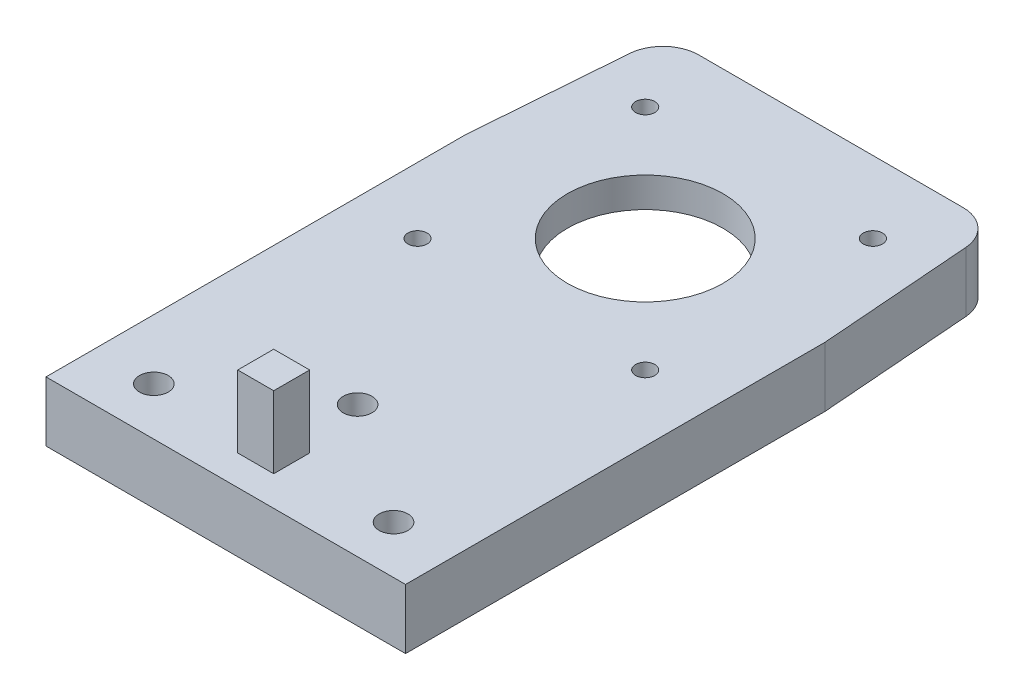
ISO-10303-21;
HEADER;
FILE_DESCRIPTION(('STEP AP214'),'2;1');
FILE_NAME('part.step','',(''),(''),'','','');
FILE_SCHEMA(('AUTOMOTIVE_DESIGN { 1 0 10303 214 1 1 1 1 }'));
ENDSEC;
DATA;
#1=APPLICATION_CONTEXT('core data for automotive mechanical design processes');
#2=APPLICATION_PROTOCOL_DEFINITION('international standard','automotive_design',2000,#1);
#3=PRODUCT_CONTEXT('',#1,'mechanical');
#4=PRODUCT('Part','Part','',(#3));
#5=PRODUCT_RELATED_PRODUCT_CATEGORY('part','',(#4));
#6=PRODUCT_DEFINITION_FORMATION('','',#4);
#7=PRODUCT_DEFINITION_CONTEXT('part definition',#1,'design');
#8=PRODUCT_DEFINITION('design','',#6,#7);
#9=PRODUCT_DEFINITION_SHAPE('','',#8);
#10=(LENGTH_UNIT() NAMED_UNIT(*) SI_UNIT(.MILLI.,.METRE.));
#11=(NAMED_UNIT(*) PLANE_ANGLE_UNIT() SI_UNIT($,.RADIAN.));
#12=(NAMED_UNIT(*) SI_UNIT($,.STERADIAN.) SOLID_ANGLE_UNIT());
#13=UNCERTAINTY_MEASURE_WITH_UNIT(LENGTH_MEASURE(1.E-05),#10,'distance_accuracy_value','');
#14=(GEOMETRIC_REPRESENTATION_CONTEXT(3) GLOBAL_UNCERTAINTY_ASSIGNED_CONTEXT((#13)) GLOBAL_UNIT_ASSIGNED_CONTEXT((#10,
#11,#12)) REPRESENTATION_CONTEXT('',''));
#15=CARTESIAN_POINT('',(0.,0.,0.));
#16=DIRECTION('',(0.,0.,1.));
#17=DIRECTION('',(1.,0.,0.));
#18=AXIS2_PLACEMENT_3D('',#15,#16,#17);
#19=CARTESIAN_POINT('',(-10.5,2.5,-45.5));
#20=DIRECTION('',(0.,1.,0.));
#21=DIRECTION('',(0.,0.,1.));
#22=AXIS2_PLACEMENT_3D('',#19,#20,#21);
#23=PLANE('',#22);
#24=CARTESIAN_POINT('',(9.5,2.5,-25.5));
#25=DIRECTION('',(0.,-1.,0.));
#26=DIRECTION('',(0.,0.,-1.));
#27=AXIS2_PLACEMENT_3D('',#24,#25,#26);
#28=CIRCLE('',#27,0.799999999999988);
#29=CARTESIAN_POINT('',(9.5,2.5,-26.3));
#30=VERTEX_POINT('',#29);
#31=EDGE_CURVE('E707',#30,#30,#28,.T.);
#32=ORIENTED_EDGE('',*,*,#31,.F.);
#33=EDGE_LOOP('',(#32));
#34=FACE_BOUND('',#33,.T.);
#35=CARTESIAN_POINT('',(-10.5,2.5,-45.5));
#36=DIRECTION('',(0.,-1.,0.));
#37=DIRECTION('',(0.,0.,1.));
#38=AXIS2_PLACEMENT_3D('',#35,#36,#37);
#39=CIRCLE('',#38,2.5);
#40=CARTESIAN_POINT('',(-13.,2.5,-45.5));
#41=VERTEX_POINT('',#40);
#42=CARTESIAN_POINT('',(-10.5,2.5,-48.));
#43=VERTEX_POINT('',#42);
#44=EDGE_CURVE('E183',#41,#43,#39,.T.);
#45=ORIENTED_EDGE('',*,*,#44,.T.);
#46=DIRECTION('',(1.,0.,0.));
#47=VECTOR('',#46,1.);
#48=CARTESIAN_POINT('',(-10.5,2.5,-48.));
#49=LINE('',#48,#47);
#50=CARTESIAN_POINT('',(10.5,2.5,-48.));
#51=VERTEX_POINT('',#50);
#52=EDGE_CURVE('E194',#43,#51,#49,.T.);
#53=ORIENTED_EDGE('',*,*,#52,.T.);
#54=CARTESIAN_POINT('',(10.5,2.5,-45.5));
#55=DIRECTION('',(0.,-1.,0.));
#56=DIRECTION('',(0.,0.,-1.));
#57=AXIS2_PLACEMENT_3D('',#54,#55,#56);
#58=CIRCLE('',#57,2.5);
#59=CARTESIAN_POINT('',(13.,2.5,-45.5));
#60=VERTEX_POINT('',#59);
#61=EDGE_CURVE('E199',#51,#60,#58,.T.);
#62=ORIENTED_EDGE('',*,*,#61,.T.);
#63=DIRECTION('',(0.,0.,1.));
#64=VECTOR('',#63,1.);
#65=CARTESIAN_POINT('',(13.,2.5,-45.5));
#66=LINE('',#65,#64);
#67=CARTESIAN_POINT('',(13.,2.5,-24.5));
#68=VERTEX_POINT('',#67);
#69=EDGE_CURVE('E214',#60,#68,#66,.T.);
#70=ORIENTED_EDGE('',*,*,#69,.T.);
#71=CARTESIAN_POINT('',(10.5,2.5,-24.5));
#72=DIRECTION('',(0.,-1.,0.));
#73=DIRECTION('',(0.,0.,1.));
#74=AXIS2_PLACEMENT_3D('',#71,#72,#73);
#75=CIRCLE('',#74,2.5);
#76=CARTESIAN_POINT('',(10.5,2.5,-22.));
#77=VERTEX_POINT('',#76);
#78=EDGE_CURVE('E217',#68,#77,#75,.T.);
#79=ORIENTED_EDGE('',*,*,#78,.T.);
#80=DIRECTION('',(-1.,0.,0.));
#81=VECTOR('',#80,1.);
#82=CARTESIAN_POINT('',(-10.5,2.5,-22.));
#83=LINE('',#82,#81);
#84=CARTESIAN_POINT('',(-10.5,2.5,-22.));
#85=VERTEX_POINT('',#84);
#86=EDGE_CURVE('E220',#77,#85,#83,.T.);
#87=ORIENTED_EDGE('',*,*,#86,.T.);
#88=CARTESIAN_POINT('',(-10.5,2.5,-24.5));
#89=DIRECTION('',(0.,-1.,0.));
#90=DIRECTION('',(0.,0.,1.));
#91=AXIS2_PLACEMENT_3D('',#88,#89,#90);
#92=CIRCLE('',#91,2.5);
#93=CARTESIAN_POINT('',(-13.,2.5,-24.5));
#94=VERTEX_POINT('',#93);
#95=EDGE_CURVE('E223',#85,#94,#92,.T.);
#96=ORIENTED_EDGE('',*,*,#95,.T.);
#97=DIRECTION('',(0.,0.,-1.));
#98=VECTOR('',#97,1.);
#99=CARTESIAN_POINT('',(-13.,2.5,-45.5));
#100=LINE('',#99,#98);
#101=EDGE_CURVE('E191',#94,#41,#100,.T.);
#102=ORIENTED_EDGE('',*,*,#101,.T.);
#103=EDGE_LOOP('',(#45,#53,#62,#70,#79,#87,#96,#102));
#104=FACE_BOUND('',#103,.T.);
#105=CARTESIAN_POINT('',(0.,2.5,-35.));
#106=DIRECTION('',(0.,1.,0.));
#107=DIRECTION('',(0.,0.,1.));
#108=AXIS2_PLACEMENT_3D('',#105,#106,#107);
#109=CIRCLE('',#108,6.4897);
#110=CARTESIAN_POINT('',(0.,2.5,-28.5103));
#111=VERTEX_POINT('',#110);
#112=EDGE_CURVE('E245',#111,#111,#109,.F.);
#113=ORIENTED_EDGE('',*,*,#112,.F.);
#114=EDGE_LOOP('',(#113));
#115=FACE_BOUND('',#114,.T.);
#116=CARTESIAN_POINT('',(9.5,2.5,-44.5));
#117=DIRECTION('',(0.,-1.,0.));
#118=DIRECTION('',(0.,0.,-1.));
#119=AXIS2_PLACEMENT_3D('',#116,#117,#118);
#120=CIRCLE('',#119,0.799999999999988);
#121=CARTESIAN_POINT('',(9.5,2.5,-45.3));
#122=VERTEX_POINT('',#121);
#123=EDGE_CURVE('E702',#122,#122,#120,.T.);
#124=ORIENTED_EDGE('',*,*,#123,.F.);
#125=EDGE_LOOP('',(#124));
#126=FACE_BOUND('',#125,.T.);
#127=CARTESIAN_POINT('',(-9.5,2.5,-44.5));
#128=DIRECTION('',(0.,-1.,0.));
#129=DIRECTION('',(0.,0.,-1.));
#130=AXIS2_PLACEMENT_3D('',#127,#128,#129);
#131=CIRCLE('',#130,0.799999999999988);
#132=CARTESIAN_POINT('',(-9.5,2.5,-45.3));
#133=VERTEX_POINT('',#132);
#134=EDGE_CURVE('E694',#133,#133,#131,.T.);
#135=ORIENTED_EDGE('',*,*,#134,.F.);
#136=EDGE_LOOP('',(#135));
#137=FACE_BOUND('',#136,.T.);
#138=CARTESIAN_POINT('',(-9.5,2.5,-25.5));
#139=DIRECTION('',(0.,-1.,0.));
#140=DIRECTION('',(0.,0.,-1.));
#141=AXIS2_PLACEMENT_3D('',#138,#139,#140);
#142=CIRCLE('',#141,0.799999999999988);
#143=CARTESIAN_POINT('',(-9.5,2.5,-26.3));
#144=VERTEX_POINT('',#143);
#145=EDGE_CURVE('E691',#144,#144,#142,.T.);
#146=ORIENTED_EDGE('',*,*,#145,.F.);
#147=EDGE_LOOP('',(#146));
#148=FACE_BOUND('',#147,.T.);
#149=ADVANCED_FACE('F39',(#34,#104,#115,#126,#137,#148),#23,.F.);
#150=CARTESIAN_POINT('',(0.,5.,0.));
#151=DIRECTION('',(0.,-1.,0.));
#152=DIRECTION('',(0.,0.,-1.));
#153=AXIS2_PLACEMENT_3D('',#150,#151,#152);
#154=PLANE('',#153);
#155=CARTESIAN_POINT('',(-9.5,5.,-25.5));
#156=DIRECTION('',(0.,-1.,0.));
#157=DIRECTION('',(0.,0.,-1.));
#158=AXIS2_PLACEMENT_3D('',#155,#156,#157);
#159=CIRCLE('',#158,0.799999999999993);
#160=CARTESIAN_POINT('',(-9.5,5.,-26.3));
#161=VERTEX_POINT('',#160);
#162=EDGE_CURVE('E688',#161,#161,#159,.T.);
#163=ORIENTED_EDGE('',*,*,#162,.T.);
#164=EDGE_LOOP('',(#163));
#165=FACE_BOUND('',#164,.T.);
#166=CARTESIAN_POINT('',(-9.5,5.,-44.5));
#167=DIRECTION('',(0.,-1.,0.));
#168=DIRECTION('',(0.,0.,-1.));
#169=AXIS2_PLACEMENT_3D('',#166,#167,#168);
#170=CIRCLE('',#169,0.799999999999993);
#171=CARTESIAN_POINT('',(-9.5,5.,-45.3));
#172=VERTEX_POINT('',#171);
#173=EDGE_CURVE('E699',#172,#172,#170,.T.);
#174=ORIENTED_EDGE('',*,*,#173,.T.);
#175=EDGE_LOOP('',(#174));
#176=FACE_BOUND('',#175,.T.);
#177=CARTESIAN_POINT('',(9.5,5.,-44.5));
#178=DIRECTION('',(0.,-1.,0.));
#179=DIRECTION('',(0.,0.,-1.));
#180=AXIS2_PLACEMENT_3D('',#177,#178,#179);
#181=CIRCLE('',#180,0.799999999999993);
#182=CARTESIAN_POINT('',(9.5,5.,-45.3));
#183=VERTEX_POINT('',#182);
#184=EDGE_CURVE('E705',#183,#183,#181,.T.);
#185=ORIENTED_EDGE('',*,*,#184,.T.);
#186=EDGE_LOOP('',(#185));
#187=FACE_BOUND('',#186,.T.);
#188=CARTESIAN_POINT('',(9.5,5.,-25.5));
#189=DIRECTION('',(0.,-1.,0.));
#190=DIRECTION('',(0.,0.,-1.));
#191=AXIS2_PLACEMENT_3D('',#188,#189,#190);
#192=CIRCLE('',#191,0.799999999999993);
#193=CARTESIAN_POINT('',(9.5,5.,-26.3));
#194=VERTEX_POINT('',#193);
#195=EDGE_CURVE('E210',#194,#194,#192,.T.);
#196=ORIENTED_EDGE('',*,*,#195,.T.);
#197=EDGE_LOOP('',(#196));
#198=FACE_BOUND('',#197,.T.);
#199=CARTESIAN_POINT('',(10.,5.,-4.));
#200=DIRECTION('',(0.,-1.,0.));
#201=DIRECTION('',(0.,0.,-1.));
#202=AXIS2_PLACEMENT_3D('',#199,#200,#201);
#203=CIRCLE('',#202,1.2);
#204=CARTESIAN_POINT('',(10.,5.,-5.2));
#205=VERTEX_POINT('',#204);
#206=EDGE_CURVE('E263',#205,#205,#203,.T.);
#207=ORIENTED_EDGE('',*,*,#206,.T.);
#208=EDGE_LOOP('',(#207));
#209=FACE_BOUND('',#208,.T.);
#210=CARTESIAN_POINT('',(-10.,5.,-4.));
#211=DIRECTION('',(0.,-1.,0.));
#212=DIRECTION('',(0.,0.,-1.));
#213=AXIS2_PLACEMENT_3D('',#210,#211,#212);
#214=CIRCLE('',#213,1.2);
#215=CARTESIAN_POINT('',(-10.,5.,-5.2));
#216=VERTEX_POINT('',#215);
#217=EDGE_CURVE('E270',#216,#216,#214,.T.);
#218=ORIENTED_EDGE('',*,*,#217,.T.);
#219=EDGE_LOOP('',(#218));
#220=FACE_BOUND('',#219,.T.);
#221=CARTESIAN_POINT('',(0.,5.,-11.));
#222=DIRECTION('',(0.,-1.,0.));
#223=DIRECTION('',(0.,0.,-1.));
#224=AXIS2_PLACEMENT_3D('',#221,#222,#223);
#225=CIRCLE('',#224,1.2);
#226=CARTESIAN_POINT('',(0.,5.,-12.2));
#227=VERTEX_POINT('',#226);
#228=EDGE_CURVE('E277',#227,#227,#225,.T.);
#229=ORIENTED_EDGE('',*,*,#228,.T.);
#230=EDGE_LOOP('',(#229));
#231=FACE_BOUND('',#230,.T.);
#232=DIRECTION('',(-0.0766964988847371,0.,-0.997054485501581));
#233=VECTOR('',#232,1.);
#234=CARTESIAN_POINT('',(13.8076923076923,5.,-50.5));
#235=LINE('',#234,#233);
#236=CARTESIAN_POINT('',(15.,5.,-35.));
#237=VERTEX_POINT('',#236);
#238=CARTESIAN_POINT('',(14.0207623464112,5.,-47.7300894966542));
#239=VERTEX_POINT('',#238);
#240=EDGE_CURVE('E323',#237,#239,#235,.T.);
#241=ORIENTED_EDGE('',*,*,#240,.T.);
#242=CARTESIAN_POINT('',(11.0295988899065,5.,-47.5));
#243=DIRECTION('',(0.,-1.,0.));
#244=DIRECTION('',(0.,0.,-1.));
#245=AXIS2_PLACEMENT_3D('',#242,#243,#244);
#246=CIRCLE('',#245,3.);
#247=CARTESIAN_POINT('',(11.0295988899065,5.,-50.5));
#248=VERTEX_POINT('',#247);
#249=EDGE_CURVE('E47',#239,#248,#246,.F.);
#250=ORIENTED_EDGE('',*,*,#249,.T.);
#251=DIRECTION('',(-1.,0.,0.));
#252=VECTOR('',#251,1.);
#253=CARTESIAN_POINT('',(-13.8076923076923,5.,-50.5));
#254=LINE('',#253,#252);
#255=CARTESIAN_POINT('',(-11.0295988899065,5.,-50.5));
#256=VERTEX_POINT('',#255);
#257=EDGE_CURVE('E325',#248,#256,#254,.T.);
#258=ORIENTED_EDGE('',*,*,#257,.T.);
#259=CARTESIAN_POINT('',(-11.0295988899065,5.,-47.5));
#260=DIRECTION('',(0.,-1.,0.));
#261=DIRECTION('',(0.,0.,-1.));
#262=AXIS2_PLACEMENT_3D('',#259,#260,#261);
#263=CIRCLE('',#262,3.);
#264=CARTESIAN_POINT('',(-14.0207623464112,5.,-47.7300894966542));
#265=VERTEX_POINT('',#264);
#266=EDGE_CURVE('E54',#256,#265,#263,.F.);
#267=ORIENTED_EDGE('',*,*,#266,.T.);
#268=DIRECTION('',(-0.0766964988847371,0.,0.997054485501581));
#269=VECTOR('',#268,1.);
#270=CARTESIAN_POINT('',(-15.,5.,-35.));
#271=LINE('',#270,#269);
#272=CARTESIAN_POINT('',(-15.,5.,-35.));
#273=VERTEX_POINT('',#272);
#274=EDGE_CURVE('E327',#265,#273,#271,.T.);
#275=ORIENTED_EDGE('',*,*,#274,.T.);
#276=DIRECTION('',(0.,0.,1.));
#277=VECTOR('',#276,1.);
#278=CARTESIAN_POINT('',(-15.,5.,0.));
#279=LINE('',#278,#277);
#280=CARTESIAN_POINT('',(-15.,5.,0.));
#281=VERTEX_POINT('',#280);
#282=EDGE_CURVE('E315',#273,#281,#279,.T.);
#283=ORIENTED_EDGE('',*,*,#282,.T.);
#284=DIRECTION('',(1.,0.,0.));
#285=VECTOR('',#284,1.);
#286=CARTESIAN_POINT('',(-15.,5.,0.));
#287=LINE('',#286,#285);
#288=CARTESIAN_POINT('',(15.,5.,0.));
#289=VERTEX_POINT('',#288);
#290=EDGE_CURVE('E318',#281,#289,#287,.T.);
#291=ORIENTED_EDGE('',*,*,#290,.T.);
#292=DIRECTION('',(0.,0.,-1.));
#293=VECTOR('',#292,1.);
#294=CARTESIAN_POINT('',(15.,5.,0.));
#295=LINE('',#294,#293);
#296=EDGE_CURVE('E321',#289,#237,#295,.T.);
#297=ORIENTED_EDGE('',*,*,#296,.T.);
#298=EDGE_LOOP('',(#241,#250,#258,#267,#275,#283,#291,#297));
#299=FACE_BOUND('',#298,.T.);
#300=CARTESIAN_POINT('',(0.,5.,-35.));
#301=DIRECTION('',(0.,1.,0.));
#302=DIRECTION('',(0.,0.,1.));
#303=AXIS2_PLACEMENT_3D('',#300,#301,#302);
#304=CIRCLE('',#303,6.4897);
#305=CARTESIAN_POINT('',(0.,5.,-28.5103));
#306=VERTEX_POINT('',#305);
#307=EDGE_CURVE('E311',#306,#306,#304,.T.);
#308=ORIENTED_EDGE('',*,*,#307,.F.);
#309=EDGE_LOOP('',(#308));
#310=FACE_BOUND('',#309,.T.);
#311=DIRECTION('',(0.,0.,1.));
#312=VECTOR('',#311,1.);
#313=CARTESIAN_POINT('',(-1.5,5.,-5.5));
#314=LINE('',#313,#312);
#315=CARTESIAN_POINT('',(-1.5,5.,-5.5));
#316=VERTEX_POINT('',#315);
#317=CARTESIAN_POINT('',(-1.5,5.,-2.5));
#318=VERTEX_POINT('',#317);
#319=EDGE_CURVE('E289',#316,#318,#314,.T.);
#320=ORIENTED_EDGE('',*,*,#319,.F.);
#321=DIRECTION('',(-1.,0.,0.));
#322=VECTOR('',#321,1.);
#323=CARTESIAN_POINT('',(-1.5,5.,-5.5));
#324=LINE('',#323,#322);
#325=CARTESIAN_POINT('',(1.5,5.,-5.5));
#326=VERTEX_POINT('',#325);
#327=EDGE_CURVE('E282',#326,#316,#324,.T.);
#328=ORIENTED_EDGE('',*,*,#327,.F.);
#329=DIRECTION('',(0.,0.,-1.));
#330=VECTOR('',#329,1.);
#331=CARTESIAN_POINT('',(1.5,5.,-5.5));
#332=LINE('',#331,#330);
#333=CARTESIAN_POINT('',(1.5,5.,-2.5));
#334=VERTEX_POINT('',#333);
#335=EDGE_CURVE('E295',#334,#326,#332,.T.);
#336=ORIENTED_EDGE('',*,*,#335,.F.);
#337=DIRECTION('',(1.,0.,0.));
#338=VECTOR('',#337,1.);
#339=CARTESIAN_POINT('',(-1.5,5.,-2.5));
#340=LINE('',#339,#338);
#341=EDGE_CURVE('E292',#318,#334,#340,.T.);
#342=ORIENTED_EDGE('',*,*,#341,.F.);
#343=EDGE_LOOP('',(#320,#328,#336,#342));
#344=FACE_BOUND('',#343,.T.);
#345=ADVANCED_FACE('F373',(#165,#176,#187,#198,#209,#220,#231,#299,#310,#344),#154,.F.);
#346=CARTESIAN_POINT('',(-15.,5.,0.));
#347=DIRECTION('',(1.,0.,0.));
#348=DIRECTION('',(0.,0.,-1.));
#349=AXIS2_PLACEMENT_3D('',#346,#347,#348);
#350=PLANE('',#349);
#351=DIRECTION('',(0.,0.,1.));
#352=VECTOR('',#351,1.);
#353=CARTESIAN_POINT('',(-15.,0.,0.));
#354=LINE('',#353,#352);
#355=CARTESIAN_POINT('',(-15.,0.,-35.));
#356=VERTEX_POINT('',#355);
#357=CARTESIAN_POINT('',(-15.,0.,0.));
#358=VERTEX_POINT('',#357);
#359=EDGE_CURVE('E314',#356,#358,#354,.T.);
#360=ORIENTED_EDGE('',*,*,#359,.T.);
#361=DIRECTION('',(0.,-1.,0.));
#362=VECTOR('',#361,1.);
#363=CARTESIAN_POINT('',(-15.,5.,0.));
#364=LINE('',#363,#362);
#365=EDGE_CURVE('E350',#281,#358,#364,.T.);
#366=ORIENTED_EDGE('',*,*,#365,.F.);
#367=ORIENTED_EDGE('',*,*,#282,.F.);
#368=DIRECTION('',(0.,-1.,0.));
#369=VECTOR('',#368,1.);
#370=CARTESIAN_POINT('',(-15.,5.,-35.));
#371=LINE('',#370,#369);
#372=EDGE_CURVE('E329',#273,#356,#371,.T.);
#373=ORIENTED_EDGE('',*,*,#372,.T.);
#374=EDGE_LOOP('',(#360,#366,#367,#373));
#375=FACE_BOUND('',#374,.T.);
#376=ADVANCED_FACE('F399',(#375),#350,.F.);
#377=CARTESIAN_POINT('',(-15.,5.,0.));
#378=DIRECTION('',(0.,0.,-1.));
#379=DIRECTION('',(-1.,0.,0.));
#380=AXIS2_PLACEMENT_3D('',#377,#378,#379);
#381=PLANE('',#380);
#382=DIRECTION('',(1.,0.,0.));
#383=VECTOR('',#382,1.);
#384=CARTESIAN_POINT('',(-15.,0.,0.));
#385=LINE('',#384,#383);
#386=CARTESIAN_POINT('',(15.,0.,0.));
#387=VERTEX_POINT('',#386);
#388=EDGE_CURVE('E332',#358,#387,#385,.T.);
#389=ORIENTED_EDGE('',*,*,#388,.T.);
#390=DIRECTION('',(0.,-1.,0.));
#391=VECTOR('',#390,1.);
#392=CARTESIAN_POINT('',(15.,5.,0.));
#393=LINE('',#392,#391);
#394=EDGE_CURVE('E347',#289,#387,#393,.T.);
#395=ORIENTED_EDGE('',*,*,#394,.F.);
#396=ORIENTED_EDGE('',*,*,#290,.F.);
#397=ORIENTED_EDGE('',*,*,#365,.T.);
#398=EDGE_LOOP('',(#389,#395,#396,#397));
#399=FACE_BOUND('',#398,.T.);
#400=ADVANCED_FACE('F396',(#399),#381,.F.);
#401=CARTESIAN_POINT('',(15.,5.,0.));
#402=DIRECTION('',(-1.,0.,0.));
#403=DIRECTION('',(0.,0.,1.));
#404=AXIS2_PLACEMENT_3D('',#401,#402,#403);
#405=PLANE('',#404);
#406=DIRECTION('',(0.,0.,-1.));
#407=VECTOR('',#406,1.);
#408=CARTESIAN_POINT('',(15.,0.,0.));
#409=LINE('',#408,#407);
#410=CARTESIAN_POINT('',(15.,0.,-35.));
#411=VERTEX_POINT('',#410);
#412=EDGE_CURVE('E334',#387,#411,#409,.T.);
#413=ORIENTED_EDGE('',*,*,#412,.T.);
#414=DIRECTION('',(0.,-1.,0.));
#415=VECTOR('',#414,1.);
#416=CARTESIAN_POINT('',(15.,5.,-35.));
#417=LINE('',#416,#415);
#418=EDGE_CURVE('E344',#237,#411,#417,.T.);
#419=ORIENTED_EDGE('',*,*,#418,.F.);
#420=ORIENTED_EDGE('',*,*,#296,.F.);
#421=ORIENTED_EDGE('',*,*,#394,.T.);
#422=EDGE_LOOP('',(#413,#419,#420,#421));
#423=FACE_BOUND('',#422,.T.);
#424=ADVANCED_FACE('F390',(#423),#405,.F.);
#425=CARTESIAN_POINT('',(13.8076923076923,5.,-50.5));
#426=DIRECTION('',(-0.997054485501582,0.,0.0766964988847372));
#427=DIRECTION('',(0.0766964988847372,0.,0.997054485501582));
#428=AXIS2_PLACEMENT_3D('',#425,#426,#427);
#429=PLANE('',#428);
#430=DIRECTION('',(-0.0766964988847371,0.,-0.997054485501581));
#431=VECTOR('',#430,1.);
#432=CARTESIAN_POINT('',(13.8076923076923,0.,-50.5));
#433=LINE('',#432,#431);
#434=CARTESIAN_POINT('',(14.0207623464112,0.,-47.7300894966542));
#435=VERTEX_POINT('',#434);
#436=EDGE_CURVE('E336',#411,#435,#433,.T.);
#437=ORIENTED_EDGE('',*,*,#436,.T.);
#438=DIRECTION('',(0.,-1.,0.));
#439=VECTOR('',#438,1.);
#440=CARTESIAN_POINT('',(14.0207623464112,5.,-47.7300894966542));
#441=LINE('',#440,#439);
#442=EDGE_CURVE('E62',#435,#239,#441,.F.);
#443=ORIENTED_EDGE('',*,*,#442,.T.);
#444=ORIENTED_EDGE('',*,*,#240,.F.);
#445=ORIENTED_EDGE('',*,*,#418,.T.);
#446=EDGE_LOOP('',(#437,#443,#444,#445));
#447=FACE_BOUND('',#446,.T.);
#448=ADVANCED_FACE('F386',(#447),#429,.F.);
#449=CARTESIAN_POINT('',(-13.8076923076923,5.,-50.5));
#450=DIRECTION('',(0.,0.,1.));
#451=DIRECTION('',(1.,0.,0.));
#452=AXIS2_PLACEMENT_3D('',#449,#450,#451);
#453=PLANE('',#452);
#454=ORIENTED_EDGE('',*,*,#257,.F.);
#455=DIRECTION('',(0.,-1.,0.));
#456=VECTOR('',#455,1.);
#457=CARTESIAN_POINT('',(11.0295988899065,5.,-50.5));
#458=LINE('',#457,#456);
#459=CARTESIAN_POINT('',(11.0295988899065,0.,-50.5));
#460=VERTEX_POINT('',#459);
#461=EDGE_CURVE('E363',#248,#460,#458,.T.);
#462=ORIENTED_EDGE('',*,*,#461,.T.);
#463=DIRECTION('',(-1.,0.,0.));
#464=VECTOR('',#463,1.);
#465=CARTESIAN_POINT('',(-13.8076923076923,0.,-50.5));
#466=LINE('',#465,#464);
#467=CARTESIAN_POINT('',(-11.0295988899065,0.,-50.5));
#468=VERTEX_POINT('',#467);
#469=EDGE_CURVE('E338',#460,#468,#466,.T.);
#470=ORIENTED_EDGE('',*,*,#469,.T.);
#471=DIRECTION('',(0.,-1.,0.));
#472=VECTOR('',#471,1.);
#473=CARTESIAN_POINT('',(-11.0295988899065,5.,-50.5));
#474=LINE('',#473,#472);
#475=EDGE_CURVE('E353',#468,#256,#474,.F.);
#476=ORIENTED_EDGE('',*,*,#475,.T.);
#477=EDGE_LOOP('',(#454,#462,#470,#476));
#478=FACE_BOUND('',#477,.T.);
#479=ADVANCED_FACE('F378',(#478),#453,.F.);
#480=CARTESIAN_POINT('',(-15.,5.,-35.));
#481=DIRECTION('',(0.997054485501582,0.,0.0766964988847372));
#482=DIRECTION('',(0.0766964988847372,0.,-0.997054485501582));
#483=AXIS2_PLACEMENT_3D('',#480,#481,#482);
#484=PLANE('',#483);
#485=ORIENTED_EDGE('',*,*,#274,.F.);
#486=DIRECTION('',(0.,-1.,0.));
#487=VECTOR('',#486,1.);
#488=CARTESIAN_POINT('',(-14.0207623464112,5.,-47.7300894966542));
#489=LINE('',#488,#487);
#490=CARTESIAN_POINT('',(-14.0207623464112,0.,-47.7300894966542));
#491=VERTEX_POINT('',#490);
#492=EDGE_CURVE('E11',#265,#491,#489,.T.);
#493=ORIENTED_EDGE('',*,*,#492,.T.);
#494=DIRECTION('',(-0.0766964988847371,0.,0.997054485501581));
#495=VECTOR('',#494,1.);
#496=CARTESIAN_POINT('',(-15.,0.,-35.));
#497=LINE('',#496,#495);
#498=EDGE_CURVE('E319',#491,#356,#497,.T.);
#499=ORIENTED_EDGE('',*,*,#498,.T.);
#500=ORIENTED_EDGE('',*,*,#372,.F.);
#501=EDGE_LOOP('',(#485,#493,#499,#500));
#502=FACE_BOUND('',#501,.T.);
#503=ADVANCED_FACE('F402',(#502),#484,.F.);
#504=CARTESIAN_POINT('',(0.,0.,0.));
#505=DIRECTION('',(0.,-1.,0.));
#506=DIRECTION('',(0.,0.,-1.));
#507=AXIS2_PLACEMENT_3D('',#504,#505,#506);
#508=PLANE('',#507);
#509=CARTESIAN_POINT('',(-10.5,0.,-45.5));
#510=DIRECTION('',(0.,-1.,0.));
#511=DIRECTION('',(0.,0.,1.));
#512=AXIS2_PLACEMENT_3D('',#509,#510,#511);
#513=CIRCLE('',#512,2.5);
#514=CARTESIAN_POINT('',(-13.,0.,-45.5));
#515=VERTEX_POINT('',#514);
#516=CARTESIAN_POINT('',(-10.5,0.,-48.));
#517=VERTEX_POINT('',#516);
#518=EDGE_CURVE('E186',#515,#517,#513,.T.);
#519=ORIENTED_EDGE('',*,*,#518,.F.);
#520=DIRECTION('',(0.,0.,-1.));
#521=VECTOR('',#520,1.);
#522=CARTESIAN_POINT('',(-13.,0.,-45.5));
#523=LINE('',#522,#521);
#524=CARTESIAN_POINT('',(-13.,0.,-24.5));
#525=VERTEX_POINT('',#524);
#526=EDGE_CURVE('E204',#525,#515,#523,.T.);
#527=ORIENTED_EDGE('',*,*,#526,.F.);
#528=CARTESIAN_POINT('',(-10.5,0.,-24.5));
#529=DIRECTION('',(0.,-1.,0.));
#530=DIRECTION('',(0.,0.,1.));
#531=AXIS2_PLACEMENT_3D('',#528,#529,#530);
#532=CIRCLE('',#531,2.5);
#533=CARTESIAN_POINT('',(-10.5,0.,-22.));
#534=VERTEX_POINT('',#533);
#535=EDGE_CURVE('E207',#534,#525,#532,.T.);
#536=ORIENTED_EDGE('',*,*,#535,.F.);
#537=DIRECTION('',(-1.,0.,0.));
#538=VECTOR('',#537,1.);
#539=CARTESIAN_POINT('',(-10.5,0.,-22.));
#540=LINE('',#539,#538);
#541=CARTESIAN_POINT('',(10.5,0.,-22.));
#542=VERTEX_POINT('',#541);
#543=EDGE_CURVE('E238',#542,#534,#540,.T.);
#544=ORIENTED_EDGE('',*,*,#543,.F.);
#545=CARTESIAN_POINT('',(10.5,0.,-24.5));
#546=DIRECTION('',(0.,-1.,0.));
#547=DIRECTION('',(0.,0.,1.));
#548=AXIS2_PLACEMENT_3D('',#545,#546,#547);
#549=CIRCLE('',#548,2.5);
#550=CARTESIAN_POINT('',(13.,0.,-24.5));
#551=VERTEX_POINT('',#550);
#552=EDGE_CURVE('E235',#551,#542,#549,.T.);
#553=ORIENTED_EDGE('',*,*,#552,.F.);
#554=DIRECTION('',(0.,0.,1.));
#555=VECTOR('',#554,1.);
#556=CARTESIAN_POINT('',(13.,0.,-45.5));
#557=LINE('',#556,#555);
#558=CARTESIAN_POINT('',(13.,0.,-45.5));
#559=VERTEX_POINT('',#558);
#560=EDGE_CURVE('E232',#559,#551,#557,.T.);
#561=ORIENTED_EDGE('',*,*,#560,.F.);
#562=CARTESIAN_POINT('',(10.5,0.,-45.5));
#563=DIRECTION('',(0.,-1.,0.));
#564=DIRECTION('',(0.,0.,-1.));
#565=AXIS2_PLACEMENT_3D('',#562,#563,#564);
#566=CIRCLE('',#565,2.5);
#567=CARTESIAN_POINT('',(10.5,0.,-48.));
#568=VERTEX_POINT('',#567);
#569=EDGE_CURVE('E229',#568,#559,#566,.T.);
#570=ORIENTED_EDGE('',*,*,#569,.F.);
#571=DIRECTION('',(1.,0.,0.));
#572=VECTOR('',#571,1.);
#573=CARTESIAN_POINT('',(-10.5,0.,-48.));
#574=LINE('',#573,#572);
#575=EDGE_CURVE('E227',#517,#568,#574,.T.);
#576=ORIENTED_EDGE('',*,*,#575,.F.);
#577=EDGE_LOOP('',(#519,#527,#536,#544,#553,#561,#570,#576));
#578=FACE_BOUND('',#577,.T.);
#579=CARTESIAN_POINT('',(10.,0.,-4.));
#580=DIRECTION('',(0.,-1.,0.));
#581=DIRECTION('',(0.,0.,-1.));
#582=AXIS2_PLACEMENT_3D('',#579,#580,#581);
#583=CIRCLE('',#582,2.7);
#584=CARTESIAN_POINT('',(10.,0.,-6.7));
#585=VERTEX_POINT('',#584);
#586=EDGE_CURVE('E257',#585,#585,#583,.T.);
#587=ORIENTED_EDGE('',*,*,#586,.F.);
#588=EDGE_LOOP('',(#587));
#589=FACE_BOUND('',#588,.T.);
#590=CARTESIAN_POINT('',(-10.,0.,-4.));
#591=DIRECTION('',(0.,-1.,0.));
#592=DIRECTION('',(0.,0.,-1.));
#593=AXIS2_PLACEMENT_3D('',#590,#591,#592);
#594=CIRCLE('',#593,2.7);
#595=CARTESIAN_POINT('',(-10.,0.,-6.7));
#596=VERTEX_POINT('',#595);
#597=EDGE_CURVE('E264',#596,#596,#594,.T.);
#598=ORIENTED_EDGE('',*,*,#597,.F.);
#599=EDGE_LOOP('',(#598));
#600=FACE_BOUND('',#599,.T.);
#601=CARTESIAN_POINT('',(0.,0.,-11.));
#602=DIRECTION('',(0.,-1.,0.));
#603=DIRECTION('',(0.,0.,-1.));
#604=AXIS2_PLACEMENT_3D('',#601,#602,#603);
#605=CIRCLE('',#604,2.7);
#606=CARTESIAN_POINT('',(0.,0.,-13.7));
#607=VERTEX_POINT('',#606);
#608=EDGE_CURVE('E271',#607,#607,#605,.T.);
#609=ORIENTED_EDGE('',*,*,#608,.F.);
#610=EDGE_LOOP('',(#609));
#611=FACE_BOUND('',#610,.T.);
#612=ORIENTED_EDGE('',*,*,#469,.F.);
#613=CARTESIAN_POINT('',(11.0295988899065,0.,-47.5));
#614=DIRECTION('',(0.,-1.,0.));
#615=DIRECTION('',(0.,0.,-1.));
#616=AXIS2_PLACEMENT_3D('',#613,#614,#615);
#617=CIRCLE('',#616,3.);
#618=EDGE_CURVE('E368',#460,#435,#617,.T.);
#619=ORIENTED_EDGE('',*,*,#618,.T.);
#620=ORIENTED_EDGE('',*,*,#436,.F.);
#621=ORIENTED_EDGE('',*,*,#412,.F.);
#622=ORIENTED_EDGE('',*,*,#388,.F.);
#623=ORIENTED_EDGE('',*,*,#359,.F.);
#624=ORIENTED_EDGE('',*,*,#498,.F.);
#625=CARTESIAN_POINT('',(-11.0295988899065,0.,-47.5));
#626=DIRECTION('',(0.,-1.,0.));
#627=DIRECTION('',(0.,0.,-1.));
#628=AXIS2_PLACEMENT_3D('',#625,#626,#627);
#629=CIRCLE('',#628,3.);
#630=EDGE_CURVE('E366',#491,#468,#629,.T.);
#631=ORIENTED_EDGE('',*,*,#630,.T.);
#632=EDGE_LOOP('',(#612,#619,#620,#621,#622,#623,#624,#631));
#633=FACE_BOUND('',#632,.T.);
#634=ADVANCED_FACE('F384',(#578,#589,#600,#611,#633),#508,.T.);
#635=CARTESIAN_POINT('',(0.,-0.00100000000000013,-35.));
#636=DIRECTION('',(0.,1.,0.));
#637=DIRECTION('',(0.,0.,1.));
#638=AXIS2_PLACEMENT_3D('',#635,#636,#637);
#639=CYLINDRICAL_SURFACE('',#638,6.4897);
#640=ORIENTED_EDGE('',*,*,#112,.T.);
#641=EDGE_LOOP('',(#640));
#642=FACE_BOUND('',#641,.T.);
#643=ORIENTED_EDGE('',*,*,#307,.T.);
#644=EDGE_LOOP('',(#643));
#645=FACE_BOUND('',#644,.T.);
#646=ADVANCED_FACE('F496',(#642,#645),#639,.F.);
#647=CARTESIAN_POINT('',(-1.5,11.,-5.5));
#648=DIRECTION('',(1.,0.,0.));
#649=DIRECTION('',(0.,0.,-1.));
#650=AXIS2_PLACEMENT_3D('',#647,#648,#649);
#651=PLANE('',#650);
#652=ORIENTED_EDGE('',*,*,#319,.T.);
#653=DIRECTION('',(0.,-1.,0.));
#654=VECTOR('',#653,1.);
#655=CARTESIAN_POINT('',(-1.5,11.,-2.5));
#656=LINE('',#655,#654);
#657=CARTESIAN_POINT('',(-1.5,11.,-2.5));
#658=VERTEX_POINT('',#657);
#659=EDGE_CURVE('E308',#658,#318,#656,.T.);
#660=ORIENTED_EDGE('',*,*,#659,.F.);
#661=DIRECTION('',(0.,0.,1.));
#662=VECTOR('',#661,1.);
#663=CARTESIAN_POINT('',(-1.5,11.,-5.5));
#664=LINE('',#663,#662);
#665=CARTESIAN_POINT('',(-1.5,11.,-5.5));
#666=VERTEX_POINT('',#665);
#667=EDGE_CURVE('E278',#666,#658,#664,.T.);
#668=ORIENTED_EDGE('',*,*,#667,.F.);
#669=DIRECTION('',(0.,-1.,0.));
#670=VECTOR('',#669,1.);
#671=CARTESIAN_POINT('',(-1.5,11.,-5.5));
#672=LINE('',#671,#670);
#673=EDGE_CURVE('E288',#666,#316,#672,.T.);
#674=ORIENTED_EDGE('',*,*,#673,.T.);
#675=EDGE_LOOP('',(#652,#660,#668,#674));
#676=FACE_BOUND('',#675,.T.);
#677=ADVANCED_FACE('F492',(#676),#651,.F.);
#678=CARTESIAN_POINT('',(-1.5,11.,-2.5));
#679=DIRECTION('',(0.,0.,-1.));
#680=DIRECTION('',(-1.,0.,0.));
#681=AXIS2_PLACEMENT_3D('',#678,#679,#680);
#682=PLANE('',#681);
#683=ORIENTED_EDGE('',*,*,#341,.T.);
#684=DIRECTION('',(0.,-1.,0.));
#685=VECTOR('',#684,1.);
#686=CARTESIAN_POINT('',(1.5,11.,-2.5));
#687=LINE('',#686,#685);
#688=CARTESIAN_POINT('',(1.5,11.,-2.5));
#689=VERTEX_POINT('',#688);
#690=EDGE_CURVE('E305',#689,#334,#687,.T.);
#691=ORIENTED_EDGE('',*,*,#690,.F.);
#692=DIRECTION('',(1.,0.,0.));
#693=VECTOR('',#692,1.);
#694=CARTESIAN_POINT('',(-1.5,11.,-2.5));
#695=LINE('',#694,#693);
#696=EDGE_CURVE('E281',#658,#689,#695,.T.);
#697=ORIENTED_EDGE('',*,*,#696,.F.);
#698=ORIENTED_EDGE('',*,*,#659,.T.);
#699=EDGE_LOOP('',(#683,#691,#697,#698));
#700=FACE_BOUND('',#699,.T.);
#701=ADVANCED_FACE('F488',(#700),#682,.F.);
#702=CARTESIAN_POINT('',(1.5,11.,-5.5));
#703=DIRECTION('',(-1.,0.,0.));
#704=DIRECTION('',(0.,0.,1.));
#705=AXIS2_PLACEMENT_3D('',#702,#703,#704);
#706=PLANE('',#705);
#707=ORIENTED_EDGE('',*,*,#335,.T.);
#708=DIRECTION('',(0.,-1.,0.));
#709=VECTOR('',#708,1.);
#710=CARTESIAN_POINT('',(1.5,11.,-5.5));
#711=LINE('',#710,#709);
#712=CARTESIAN_POINT('',(1.5,11.,-5.5));
#713=VERTEX_POINT('',#712);
#714=EDGE_CURVE('E302',#713,#326,#711,.T.);
#715=ORIENTED_EDGE('',*,*,#714,.F.);
#716=DIRECTION('',(0.,0.,-1.));
#717=VECTOR('',#716,1.);
#718=CARTESIAN_POINT('',(1.5,11.,-5.5));
#719=LINE('',#718,#717);
#720=EDGE_CURVE('E284',#689,#713,#719,.T.);
#721=ORIENTED_EDGE('',*,*,#720,.F.);
#722=ORIENTED_EDGE('',*,*,#690,.T.);
#723=EDGE_LOOP('',(#707,#715,#721,#722));
#724=FACE_BOUND('',#723,.T.);
#725=ADVANCED_FACE('F484',(#724),#706,.F.);
#726=CARTESIAN_POINT('',(-1.5,11.,-5.5));
#727=DIRECTION('',(0.,0.,1.));
#728=DIRECTION('',(1.,0.,0.));
#729=AXIS2_PLACEMENT_3D('',#726,#727,#728);
#730=PLANE('',#729);
#731=ORIENTED_EDGE('',*,*,#327,.T.);
#732=ORIENTED_EDGE('',*,*,#673,.F.);
#733=DIRECTION('',(-1.,0.,0.));
#734=VECTOR('',#733,1.);
#735=CARTESIAN_POINT('',(-1.5,11.,-5.5));
#736=LINE('',#735,#734);
#737=EDGE_CURVE('E286',#713,#666,#736,.T.);
#738=ORIENTED_EDGE('',*,*,#737,.F.);
#739=ORIENTED_EDGE('',*,*,#714,.T.);
#740=EDGE_LOOP('',(#731,#732,#738,#739));
#741=FACE_BOUND('',#740,.T.);
#742=ADVANCED_FACE('F480',(#741),#730,.F.);
#743=CARTESIAN_POINT('',(0.,11.,0.));
#744=DIRECTION('',(0.,1.,0.));
#745=DIRECTION('',(0.,0.,1.));
#746=AXIS2_PLACEMENT_3D('',#743,#744,#745);
#747=PLANE('',#746);
#748=ORIENTED_EDGE('',*,*,#667,.T.);
#749=ORIENTED_EDGE('',*,*,#696,.T.);
#750=ORIENTED_EDGE('',*,*,#720,.T.);
#751=ORIENTED_EDGE('',*,*,#737,.T.);
#752=EDGE_LOOP('',(#748,#749,#750,#751));
#753=FACE_BOUND('',#752,.T.);
#754=ADVANCED_FACE('F476',(#753),#747,.T.);
#755=CARTESIAN_POINT('',(0.,0.,-11.));
#756=DIRECTION('',(0.,-1.,0.));
#757=DIRECTION('',(0.,0.,-1.));
#758=AXIS2_PLACEMENT_3D('',#755,#756,#757);
#759=CYLINDRICAL_SURFACE('',#758,1.2);
#760=CARTESIAN_POINT('',(0.,1.5,-11.));
#761=DIRECTION('',(0.,-1.,0.));
#762=DIRECTION('',(0.,0.,-1.));
#763=AXIS2_PLACEMENT_3D('',#760,#761,#762);
#764=CIRCLE('',#763,1.2);
#765=CARTESIAN_POINT('',(0.,1.5,-12.2));
#766=VERTEX_POINT('',#765);
#767=EDGE_CURVE('E274',#766,#766,#764,.T.);
#768=ORIENTED_EDGE('',*,*,#767,.T.);
#769=EDGE_LOOP('',(#768));
#770=FACE_BOUND('',#769,.T.);
#771=ORIENTED_EDGE('',*,*,#228,.F.);
#772=EDGE_LOOP('',(#771));
#773=FACE_BOUND('',#772,.T.);
#774=ADVANCED_FACE('F472',(#770,#773),#759,.F.);
#775=CARTESIAN_POINT('',(0.,0.,-11.));
#776=DIRECTION('',(0.,-1.,0.));
#777=DIRECTION('',(0.,0.,-1.));
#778=AXIS2_PLACEMENT_3D('',#775,#776,#777);
#779=CONICAL_SURFACE('',#778,2.7,0.785398163397448);
#780=ORIENTED_EDGE('',*,*,#767,.F.);
#781=EDGE_LOOP('',(#780));
#782=FACE_BOUND('',#781,.T.);
#783=ORIENTED_EDGE('',*,*,#608,.T.);
#784=EDGE_LOOP('',(#783));
#785=FACE_BOUND('',#784,.T.);
#786=ADVANCED_FACE('F468',(#782,#785),#779,.F.);
#787=CARTESIAN_POINT('',(-10.,0.,-4.));
#788=DIRECTION('',(0.,-1.,0.));
#789=DIRECTION('',(0.,0.,-1.));
#790=AXIS2_PLACEMENT_3D('',#787,#788,#789);
#791=CYLINDRICAL_SURFACE('',#790,1.2);
#792=CARTESIAN_POINT('',(-10.,1.5,-4.));
#793=DIRECTION('',(0.,-1.,0.));
#794=DIRECTION('',(0.,0.,-1.));
#795=AXIS2_PLACEMENT_3D('',#792,#793,#794);
#796=CIRCLE('',#795,1.2);
#797=CARTESIAN_POINT('',(-10.,1.5,-5.2));
#798=VERTEX_POINT('',#797);
#799=EDGE_CURVE('E267',#798,#798,#796,.T.);
#800=ORIENTED_EDGE('',*,*,#799,.T.);
#801=EDGE_LOOP('',(#800));
#802=FACE_BOUND('',#801,.T.);
#803=ORIENTED_EDGE('',*,*,#217,.F.);
#804=EDGE_LOOP('',(#803));
#805=FACE_BOUND('',#804,.T.);
#806=ADVANCED_FACE('F464',(#802,#805),#791,.F.);
#807=CARTESIAN_POINT('',(-10.,0.,-4.));
#808=DIRECTION('',(0.,-1.,0.));
#809=DIRECTION('',(0.,0.,-1.));
#810=AXIS2_PLACEMENT_3D('',#807,#808,#809);
#811=CONICAL_SURFACE('',#810,2.7,0.785398163397448);
#812=ORIENTED_EDGE('',*,*,#799,.F.);
#813=EDGE_LOOP('',(#812));
#814=FACE_BOUND('',#813,.T.);
#815=ORIENTED_EDGE('',*,*,#597,.T.);
#816=EDGE_LOOP('',(#815));
#817=FACE_BOUND('',#816,.T.);
#818=ADVANCED_FACE('F460',(#814,#817),#811,.F.);
#819=CARTESIAN_POINT('',(10.,0.,-4.));
#820=DIRECTION('',(0.,-1.,0.));
#821=DIRECTION('',(0.,0.,-1.));
#822=AXIS2_PLACEMENT_3D('',#819,#820,#821);
#823=CYLINDRICAL_SURFACE('',#822,1.2);
#824=CARTESIAN_POINT('',(10.,1.5,-4.));
#825=DIRECTION('',(0.,-1.,0.));
#826=DIRECTION('',(0.,0.,-1.));
#827=AXIS2_PLACEMENT_3D('',#824,#825,#826);
#828=CIRCLE('',#827,1.2);
#829=CARTESIAN_POINT('',(10.,1.5,-5.2));
#830=VERTEX_POINT('',#829);
#831=EDGE_CURVE('E260',#830,#830,#828,.T.);
#832=ORIENTED_EDGE('',*,*,#831,.T.);
#833=EDGE_LOOP('',(#832));
#834=FACE_BOUND('',#833,.T.);
#835=ORIENTED_EDGE('',*,*,#206,.F.);
#836=EDGE_LOOP('',(#835));
#837=FACE_BOUND('',#836,.T.);
#838=ADVANCED_FACE('F456',(#834,#837),#823,.F.);
#839=CARTESIAN_POINT('',(10.,0.,-4.));
#840=DIRECTION('',(0.,-1.,0.));
#841=DIRECTION('',(0.,0.,-1.));
#842=AXIS2_PLACEMENT_3D('',#839,#840,#841);
#843=CONICAL_SURFACE('',#842,2.7,0.785398163397449);
#844=ORIENTED_EDGE('',*,*,#831,.F.);
#845=EDGE_LOOP('',(#844));
#846=FACE_BOUND('',#845,.T.);
#847=ORIENTED_EDGE('',*,*,#586,.T.);
#848=EDGE_LOOP('',(#847));
#849=FACE_BOUND('',#848,.T.);
#850=ADVANCED_FACE('F453',(#846,#849),#843,.F.);
#851=CARTESIAN_POINT('',(-10.5,2.5,-45.5));
#852=DIRECTION('',(0.,-1.,0.));
#853=DIRECTION('',(0.,0.,-1.));
#854=AXIS2_PLACEMENT_3D('',#851,#852,#853);
#855=CYLINDRICAL_SURFACE('',#854,2.5);
#856=ORIENTED_EDGE('',*,*,#518,.T.);
#857=DIRECTION('',(0.,-1.,0.));
#858=VECTOR('',#857,1.);
#859=CARTESIAN_POINT('',(-10.5,2.5,-48.));
#860=LINE('',#859,#858);
#861=EDGE_CURVE('E179',#43,#517,#860,.T.);
#862=ORIENTED_EDGE('',*,*,#861,.F.);
#863=ORIENTED_EDGE('',*,*,#44,.F.);
#864=DIRECTION('',(0.,-1.,0.));
#865=VECTOR('',#864,1.);
#866=CARTESIAN_POINT('',(-13.,2.5,-45.5));
#867=LINE('',#866,#865);
#868=EDGE_CURVE('E243',#41,#515,#867,.T.);
#869=ORIENTED_EDGE('',*,*,#868,.T.);
#870=EDGE_LOOP('',(#856,#862,#863,#869));
#871=FACE_BOUND('',#870,.T.);
#872=ADVANCED_FACE('F181',(#871),#855,.F.);
#873=CARTESIAN_POINT('',(-13.,2.5,-45.5));
#874=DIRECTION('',(-1.,0.,0.));
#875=DIRECTION('',(0.,0.,1.));
#876=AXIS2_PLACEMENT_3D('',#873,#874,#875);
#877=PLANE('',#876);
#878=ORIENTED_EDGE('',*,*,#526,.T.);
#879=ORIENTED_EDGE('',*,*,#868,.F.);
#880=ORIENTED_EDGE('',*,*,#101,.F.);
#881=DIRECTION('',(0.,-1.,0.));
#882=VECTOR('',#881,1.);
#883=CARTESIAN_POINT('',(-13.,2.5,-24.5));
#884=LINE('',#883,#882);
#885=EDGE_CURVE('E246',#94,#525,#884,.T.);
#886=ORIENTED_EDGE('',*,*,#885,.T.);
#887=EDGE_LOOP('',(#878,#879,#880,#886));
#888=FACE_BOUND('',#887,.T.);
#889=ADVANCED_FACE('F425',(#888),#877,.F.);
#890=CARTESIAN_POINT('',(-10.5,2.5,-24.5));
#891=DIRECTION('',(0.,-1.,0.));
#892=DIRECTION('',(0.,0.,-1.));
#893=AXIS2_PLACEMENT_3D('',#890,#891,#892);
#894=CYLINDRICAL_SURFACE('',#893,2.5);
#895=ORIENTED_EDGE('',*,*,#535,.T.);
#896=ORIENTED_EDGE('',*,*,#885,.F.);
#897=ORIENTED_EDGE('',*,*,#95,.F.);
#898=DIRECTION('',(0.,-1.,0.));
#899=VECTOR('',#898,1.);
#900=CARTESIAN_POINT('',(-10.5,2.5,-22.));
#901=LINE('',#900,#899);
#902=EDGE_CURVE('E248',#85,#534,#901,.T.);
#903=ORIENTED_EDGE('',*,*,#902,.T.);
#904=EDGE_LOOP('',(#895,#896,#897,#903));
#905=FACE_BOUND('',#904,.T.);
#906=ADVANCED_FACE('F428',(#905),#894,.F.);
#907=CARTESIAN_POINT('',(-10.5,2.5,-22.));
#908=DIRECTION('',(0.,0.,1.));
#909=DIRECTION('',(1.,0.,0.));
#910=AXIS2_PLACEMENT_3D('',#907,#908,#909);
#911=PLANE('',#910);
#912=ORIENTED_EDGE('',*,*,#543,.T.);
#913=ORIENTED_EDGE('',*,*,#902,.F.);
#914=ORIENTED_EDGE('',*,*,#86,.F.);
#915=DIRECTION('',(0.,-1.,0.));
#916=VECTOR('',#915,1.);
#917=CARTESIAN_POINT('',(10.5,2.5,-22.));
#918=LINE('',#917,#916);
#919=EDGE_CURVE('E250',#77,#542,#918,.T.);
#920=ORIENTED_EDGE('',*,*,#919,.T.);
#921=EDGE_LOOP('',(#912,#913,#914,#920));
#922=FACE_BOUND('',#921,.T.);
#923=ADVANCED_FACE('F432',(#922),#911,.F.);
#924=CARTESIAN_POINT('',(10.5,2.5,-24.5));
#925=DIRECTION('',(0.,-1.,0.));
#926=DIRECTION('',(0.,0.,-1.));
#927=AXIS2_PLACEMENT_3D('',#924,#925,#926);
#928=CYLINDRICAL_SURFACE('',#927,2.5);
#929=ORIENTED_EDGE('',*,*,#552,.T.);
#930=ORIENTED_EDGE('',*,*,#919,.F.);
#931=ORIENTED_EDGE('',*,*,#78,.F.);
#932=DIRECTION('',(0.,-1.,0.));
#933=VECTOR('',#932,1.);
#934=CARTESIAN_POINT('',(13.,2.5,-24.5));
#935=LINE('',#934,#933);
#936=EDGE_CURVE('E252',#68,#551,#935,.T.);
#937=ORIENTED_EDGE('',*,*,#936,.T.);
#938=EDGE_LOOP('',(#929,#930,#931,#937));
#939=FACE_BOUND('',#938,.T.);
#940=ADVANCED_FACE('F436',(#939),#928,.F.);
#941=CARTESIAN_POINT('',(13.,2.5,-45.5));
#942=DIRECTION('',(1.,0.,0.));
#943=DIRECTION('',(0.,0.,-1.));
#944=AXIS2_PLACEMENT_3D('',#941,#942,#943);
#945=PLANE('',#944);
#946=ORIENTED_EDGE('',*,*,#560,.T.);
#947=ORIENTED_EDGE('',*,*,#936,.F.);
#948=ORIENTED_EDGE('',*,*,#69,.F.);
#949=DIRECTION('',(0.,-1.,0.));
#950=VECTOR('',#949,1.);
#951=CARTESIAN_POINT('',(13.,2.5,-45.5));
#952=LINE('',#951,#950);
#953=EDGE_CURVE('E254',#60,#559,#952,.T.);
#954=ORIENTED_EDGE('',*,*,#953,.T.);
#955=EDGE_LOOP('',(#946,#947,#948,#954));
#956=FACE_BOUND('',#955,.T.);
#957=ADVANCED_FACE('F440',(#956),#945,.F.);
#958=CARTESIAN_POINT('',(10.5,2.5,-45.5));
#959=DIRECTION('',(0.,-1.,0.));
#960=DIRECTION('',(0.,0.,-1.));
#961=AXIS2_PLACEMENT_3D('',#958,#959,#960);
#962=CYLINDRICAL_SURFACE('',#961,2.5);
#963=ORIENTED_EDGE('',*,*,#569,.T.);
#964=ORIENTED_EDGE('',*,*,#953,.F.);
#965=ORIENTED_EDGE('',*,*,#61,.F.);
#966=DIRECTION('',(0.,-1.,0.));
#967=VECTOR('',#966,1.);
#968=CARTESIAN_POINT('',(10.5,2.5,-48.));
#969=LINE('',#968,#967);
#970=EDGE_CURVE('E190',#51,#568,#969,.T.);
#971=ORIENTED_EDGE('',*,*,#970,.T.);
#972=EDGE_LOOP('',(#963,#964,#965,#971));
#973=FACE_BOUND('',#972,.T.);
#974=ADVANCED_FACE('F444',(#973),#962,.F.);
#975=CARTESIAN_POINT('',(-10.5,2.5,-48.));
#976=DIRECTION('',(0.,0.,-1.));
#977=DIRECTION('',(-1.,0.,0.));
#978=AXIS2_PLACEMENT_3D('',#975,#976,#977);
#979=PLANE('',#978);
#980=ORIENTED_EDGE('',*,*,#575,.T.);
#981=ORIENTED_EDGE('',*,*,#970,.F.);
#982=ORIENTED_EDGE('',*,*,#52,.F.);
#983=ORIENTED_EDGE('',*,*,#861,.T.);
#984=EDGE_LOOP('',(#980,#981,#982,#983));
#985=FACE_BOUND('',#984,.T.);
#986=ADVANCED_FACE('F195',(#985),#979,.F.);
#987=CARTESIAN_POINT('',(11.0295988899065,5.,-47.5));
#988=DIRECTION('',(0.,-1.,0.));
#989=DIRECTION('',(0.,0.,-1.));
#990=AXIS2_PLACEMENT_3D('',#987,#988,#989);
#991=CYLINDRICAL_SURFACE('',#990,3.);
#992=ORIENTED_EDGE('',*,*,#249,.F.);
#993=ORIENTED_EDGE('',*,*,#442,.F.);
#994=ORIENTED_EDGE('',*,*,#618,.F.);
#995=ORIENTED_EDGE('',*,*,#461,.F.);
#996=EDGE_LOOP('',(#992,#993,#994,#995));
#997=FACE_BOUND('',#996,.T.);
#998=ADVANCED_FACE('F381',(#997),#991,.T.);
#999=CARTESIAN_POINT('',(-11.0295988899065,5.,-47.5));
#1000=DIRECTION('',(0.,-1.,0.));
#1001=DIRECTION('',(0.,0.,-1.));
#1002=AXIS2_PLACEMENT_3D('',#999,#1000,#1001);
#1003=CYLINDRICAL_SURFACE('',#1002,3.);
#1004=ORIENTED_EDGE('',*,*,#266,.F.);
#1005=ORIENTED_EDGE('',*,*,#475,.F.);
#1006=ORIENTED_EDGE('',*,*,#630,.F.);
#1007=ORIENTED_EDGE('',*,*,#492,.F.);
#1008=EDGE_LOOP('',(#1004,#1005,#1006,#1007));
#1009=FACE_BOUND('',#1008,.T.);
#1010=ADVANCED_FACE('F41',(#1009),#1003,.T.);
#1011=CARTESIAN_POINT('',(9.5,2.5,-25.5));
#1012=DIRECTION('',(0.,-1.,0.));
#1013=DIRECTION('',(0.,0.,-1.));
#1014=AXIS2_PLACEMENT_3D('',#1011,#1012,#1013);
#1015=CYLINDRICAL_SURFACE('',#1014,0.799999999999993);
#1016=ORIENTED_EDGE('',*,*,#195,.F.);
#1017=EDGE_LOOP('',(#1016));
#1018=FACE_BOUND('',#1017,.T.);
#1019=ORIENTED_EDGE('',*,*,#31,.T.);
#1020=EDGE_LOOP('',(#1019));
#1021=FACE_BOUND('',#1020,.T.);
#1022=ADVANCED_FACE('F406',(#1018,#1021),#1015,.F.);
#1023=CARTESIAN_POINT('',(9.5,2.5,-44.5));
#1024=DIRECTION('',(0.,-1.,0.));
#1025=DIRECTION('',(0.,0.,-1.));
#1026=AXIS2_PLACEMENT_3D('',#1023,#1024,#1025);
#1027=CYLINDRICAL_SURFACE('',#1026,0.799999999999993);
#1028=ORIENTED_EDGE('',*,*,#184,.F.);
#1029=EDGE_LOOP('',(#1028));
#1030=FACE_BOUND('',#1029,.T.);
#1031=ORIENTED_EDGE('',*,*,#123,.T.);
#1032=EDGE_LOOP('',(#1031));
#1033=FACE_BOUND('',#1032,.T.);
#1034=ADVANCED_FACE('F411',(#1030,#1033),#1027,.F.);
#1035=CARTESIAN_POINT('',(-9.5,2.5,-44.5));
#1036=DIRECTION('',(0.,-1.,0.));
#1037=DIRECTION('',(0.,0.,-1.));
#1038=AXIS2_PLACEMENT_3D('',#1035,#1036,#1037);
#1039=CYLINDRICAL_SURFACE('',#1038,0.799999999999993);
#1040=ORIENTED_EDGE('',*,*,#173,.F.);
#1041=EDGE_LOOP('',(#1040));
#1042=FACE_BOUND('',#1041,.T.);
#1043=ORIENTED_EDGE('',*,*,#134,.T.);
#1044=EDGE_LOOP('',(#1043));
#1045=FACE_BOUND('',#1044,.T.);
#1046=ADVANCED_FACE('F656',(#1042,#1045),#1039,.F.);
#1047=CARTESIAN_POINT('',(-9.5,2.5,-25.5));
#1048=DIRECTION('',(0.,-1.,0.));
#1049=DIRECTION('',(0.,0.,-1.));
#1050=AXIS2_PLACEMENT_3D('',#1047,#1048,#1049);
#1051=CYLINDRICAL_SURFACE('',#1050,0.799999999999993);
#1052=ORIENTED_EDGE('',*,*,#162,.F.);
#1053=EDGE_LOOP('',(#1052));
#1054=FACE_BOUND('',#1053,.T.);
#1055=ORIENTED_EDGE('',*,*,#145,.T.);
#1056=EDGE_LOOP('',(#1055));
#1057=FACE_BOUND('',#1056,.T.);
#1058=ADVANCED_FACE('F666',(#1054,#1057),#1051,.F.);
#1059=CLOSED_SHELL('',(#149,#345,#376,#400,#424,#448,#479,#503,#634,#646,#677,#701,#725,#742,
#754,#774,#786,#806,#818,#838,#850,#872,#889,#906,#923,#940,#957,#974,#986,#998,#1010,#1022,
#1034,#1046,#1058));
#1060=MANIFOLD_SOLID_BREP('B2',#1059);
#1061=ADVANCED_BREP_SHAPE_REPRESENTATION('',(#18,#1060),#14);
#1062=SHAPE_DEFINITION_REPRESENTATION(#9,#1061);
ENDSEC;
END-ISO-10303-21;
